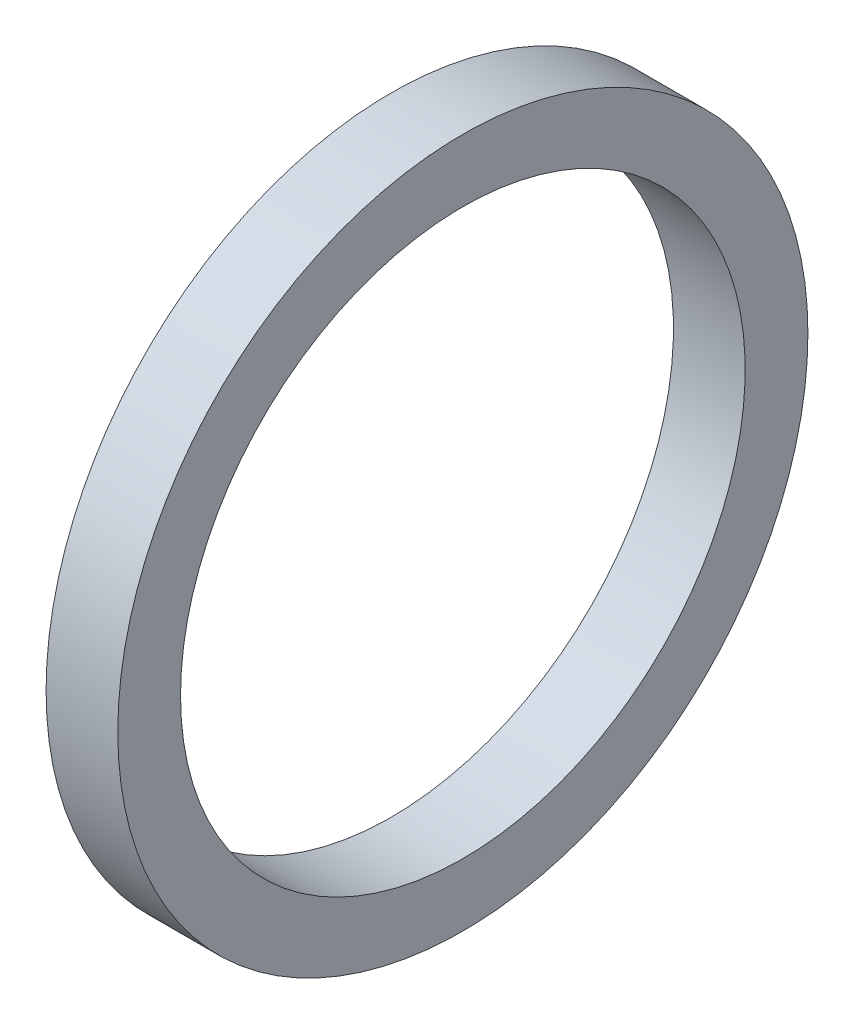
ISO-10303-21;
HEADER;
FILE_DESCRIPTION(('STEP AP214'),'2;1');
FILE_NAME('part.step','',(''),(''),'','','');
FILE_SCHEMA(('AUTOMOTIVE_DESIGN { 1 0 10303 214 1 1 1 1 }'));
ENDSEC;
DATA;
#1=APPLICATION_CONTEXT('core data for automotive mechanical design processes');
#2=APPLICATION_PROTOCOL_DEFINITION('international standard','automotive_design',2000,#1);
#3=PRODUCT_CONTEXT('',#1,'mechanical');
#4=PRODUCT('Part','Part','',(#3));
#5=PRODUCT_RELATED_PRODUCT_CATEGORY('part','',(#4));
#6=PRODUCT_DEFINITION_FORMATION('','',#4);
#7=PRODUCT_DEFINITION_CONTEXT('part definition',#1,'design');
#8=PRODUCT_DEFINITION('design','',#6,#7);
#9=PRODUCT_DEFINITION_SHAPE('','',#8);
#10=(LENGTH_UNIT() NAMED_UNIT(*) SI_UNIT(.MILLI.,.METRE.));
#11=(NAMED_UNIT(*) PLANE_ANGLE_UNIT() SI_UNIT($,.RADIAN.));
#12=(NAMED_UNIT(*) SI_UNIT($,.STERADIAN.) SOLID_ANGLE_UNIT());
#13=UNCERTAINTY_MEASURE_WITH_UNIT(LENGTH_MEASURE(1.E-05),#10,'distance_accuracy_value','');
#14=(GEOMETRIC_REPRESENTATION_CONTEXT(3) GLOBAL_UNCERTAINTY_ASSIGNED_CONTEXT((#13)) GLOBAL_UNIT_ASSIGNED_CONTEXT((#10,
#11,#12)) REPRESENTATION_CONTEXT('',''));
#15=CARTESIAN_POINT('',(0.,0.,0.));
#16=DIRECTION('',(0.,0.,1.));
#17=DIRECTION('',(1.,0.,0.));
#18=AXIS2_PLACEMENT_3D('',#15,#16,#17);
#19=CARTESIAN_POINT('',(0.,-8.001,0.));
#20=DIRECTION('',(-1.,0.,0.));
#21=DIRECTION('',(0.,0.,1.));
#22=AXIS2_PLACEMENT_3D('',#19,#20,#21);
#23=PLANE('',#22);
#24=CARTESIAN_POINT('',(0.,0.,0.));
#25=DIRECTION('',(-1.,0.,0.));
#26=DIRECTION('',(0.,0.,1.));
#27=AXIS2_PLACEMENT_3D('',#24,#25,#26);
#28=CIRCLE('',#27,9.779);
#29=CARTESIAN_POINT('',(0.,0.,9.779));
#30=VERTEX_POINT('',#29);
#31=EDGE_CURVE('E10',#30,#30,#28,.T.);
#32=ORIENTED_EDGE('',*,*,#31,.T.);
#33=EDGE_LOOP('',(#32));
#34=FACE_BOUND('',#33,.T.);
#35=CARTESIAN_POINT('',(0.,0.,0.));
#36=DIRECTION('',(-1.,0.,0.));
#37=DIRECTION('',(0.,0.,1.));
#38=AXIS2_PLACEMENT_3D('',#35,#36,#37);
#39=CIRCLE('',#38,8.001);
#40=CARTESIAN_POINT('',(0.,0.,8.001));
#41=VERTEX_POINT('',#40);
#42=EDGE_CURVE('E43',#41,#41,#39,.T.);
#43=ORIENTED_EDGE('',*,*,#42,.F.);
#44=EDGE_LOOP('',(#43));
#45=FACE_BOUND('',#44,.T.);
#46=ADVANCED_FACE('F29',(#34,#45),#23,.T.);
#47=CARTESIAN_POINT('',(-43.7165807560137,0.,0.));
#48=DIRECTION('',(-1.,0.,0.));
#49=DIRECTION('',(0.,0.,1.));
#50=AXIS2_PLACEMENT_3D('',#47,#48,#49);
#51=CYLINDRICAL_SURFACE('',#50,9.779);
#52=CARTESIAN_POINT('',(2.032,0.,0.));
#53=DIRECTION('',(-1.,0.,0.));
#54=DIRECTION('',(0.,0.,1.));
#55=AXIS2_PLACEMENT_3D('',#52,#53,#54);
#56=CIRCLE('',#55,9.779);
#57=CARTESIAN_POINT('',(2.032,0.,9.779));
#58=VERTEX_POINT('',#57);
#59=EDGE_CURVE('E35',#58,#58,#56,.T.);
#60=ORIENTED_EDGE('',*,*,#59,.T.);
#61=EDGE_LOOP('',(#60));
#62=FACE_BOUND('',#61,.T.);
#63=ORIENTED_EDGE('',*,*,#31,.F.);
#64=EDGE_LOOP('',(#63));
#65=FACE_BOUND('',#64,.T.);
#66=ADVANCED_FACE('F53',(#62,#65),#51,.T.);
#67=CARTESIAN_POINT('',(2.032,-8.001,0.));
#68=DIRECTION('',(1.,0.,0.));
#69=DIRECTION('',(0.,0.,-1.));
#70=AXIS2_PLACEMENT_3D('',#67,#68,#69);
#71=PLANE('',#70);
#72=CARTESIAN_POINT('',(2.032,0.,0.));
#73=DIRECTION('',(-1.,0.,0.));
#74=DIRECTION('',(0.,0.,1.));
#75=AXIS2_PLACEMENT_3D('',#72,#73,#74);
#76=CIRCLE('',#75,8.001);
#77=CARTESIAN_POINT('',(2.032,0.,8.001));
#78=VERTEX_POINT('',#77);
#79=EDGE_CURVE('E39',#78,#78,#76,.T.);
#80=ORIENTED_EDGE('',*,*,#79,.T.);
#81=EDGE_LOOP('',(#80));
#82=FACE_BOUND('',#81,.T.);
#83=ORIENTED_EDGE('',*,*,#59,.F.);
#84=EDGE_LOOP('',(#83));
#85=FACE_BOUND('',#84,.T.);
#86=ADVANCED_FACE('F57',(#82,#85),#71,.T.);
#87=CARTESIAN_POINT('',(-43.7165807560137,0.,0.));
#88=DIRECTION('',(-1.,0.,0.));
#89=DIRECTION('',(0.,0.,1.));
#90=AXIS2_PLACEMENT_3D('',#87,#88,#89);
#91=CYLINDRICAL_SURFACE('',#90,8.001);
#92=ORIENTED_EDGE('',*,*,#42,.T.);
#93=EDGE_LOOP('',(#92));
#94=FACE_BOUND('',#93,.T.);
#95=ORIENTED_EDGE('',*,*,#79,.F.);
#96=EDGE_LOOP('',(#95));
#97=FACE_BOUND('',#96,.T.);
#98=ADVANCED_FACE('F49',(#94,#97),#91,.F.);
#99=CLOSED_SHELL('',(#46,#66,#86,#98));
#100=MANIFOLD_SOLID_BREP('B2',#99);
#101=ADVANCED_BREP_SHAPE_REPRESENTATION('',(#18,#100),#14);
#102=SHAPE_DEFINITION_REPRESENTATION(#9,#101);
ENDSEC;
END-ISO-10303-21;
